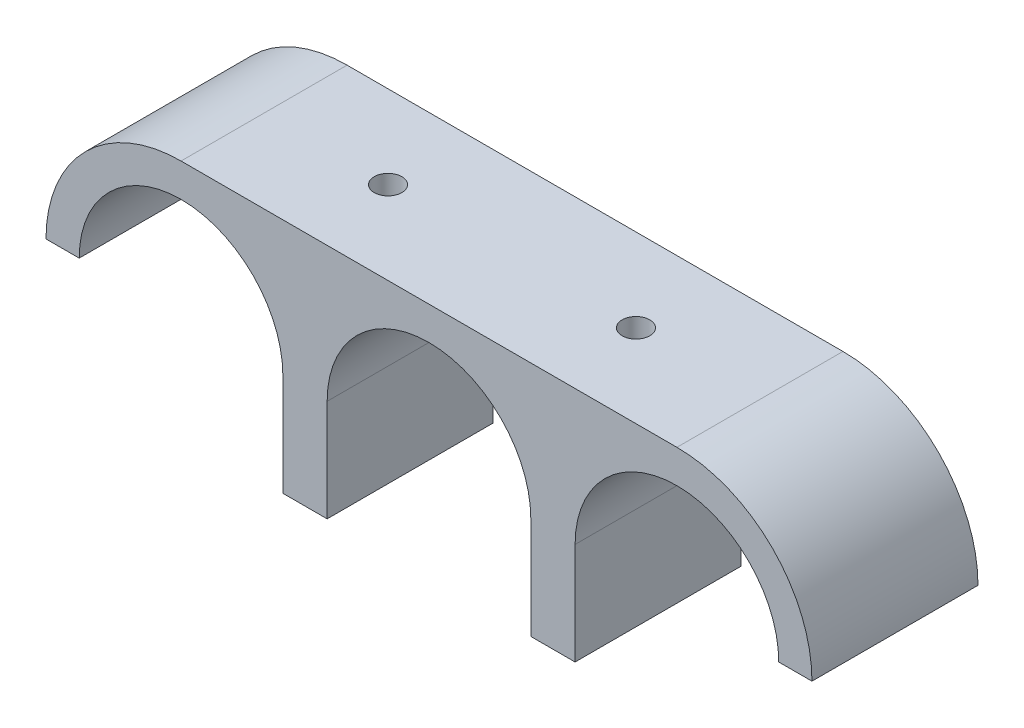
ISO-10303-21;
HEADER;
FILE_DESCRIPTION(('STEP AP214'),'2;1');
FILE_NAME('part.step','',(''),(''),'','','');
FILE_SCHEMA(('AUTOMOTIVE_DESIGN { 1 0 10303 214 1 1 1 1 }'));
ENDSEC;
DATA;
#1=APPLICATION_CONTEXT('core data for automotive mechanical design processes');
#2=APPLICATION_PROTOCOL_DEFINITION('international standard','automotive_design',2000,#1);
#3=PRODUCT_CONTEXT('',#1,'mechanical');
#4=PRODUCT('Part','Part','',(#3));
#5=PRODUCT_RELATED_PRODUCT_CATEGORY('part','',(#4));
#6=PRODUCT_DEFINITION_FORMATION('','',#4);
#7=PRODUCT_DEFINITION_CONTEXT('part definition',#1,'design');
#8=PRODUCT_DEFINITION('design','',#6,#7);
#9=PRODUCT_DEFINITION_SHAPE('','',#8);
#10=(LENGTH_UNIT() NAMED_UNIT(*) SI_UNIT(.MILLI.,.METRE.));
#11=(NAMED_UNIT(*) PLANE_ANGLE_UNIT() SI_UNIT($,.RADIAN.));
#12=(NAMED_UNIT(*) SI_UNIT($,.STERADIAN.) SOLID_ANGLE_UNIT());
#13=UNCERTAINTY_MEASURE_WITH_UNIT(LENGTH_MEASURE(1.E-05),#10,'distance_accuracy_value','');
#14=(GEOMETRIC_REPRESENTATION_CONTEXT(3) GLOBAL_UNCERTAINTY_ASSIGNED_CONTEXT((#13)) GLOBAL_UNIT_ASSIGNED_CONTEXT((#10,
#11,#12)) REPRESENTATION_CONTEXT('',''));
#15=CARTESIAN_POINT('',(0.,0.,0.));
#16=DIRECTION('',(0.,0.,1.));
#17=DIRECTION('',(1.,0.,0.));
#18=AXIS2_PLACEMENT_3D('',#15,#16,#17);
#19=CARTESIAN_POINT('',(26.4096952908587,0.,15.));
#20=DIRECTION('',(0.,0.,-1.));
#21=DIRECTION('',(-1.,0.,0.));
#22=AXIS2_PLACEMENT_3D('',#19,#20,#21);
#23=CYLINDRICAL_SURFACE('',#22,9.2);
#24=CARTESIAN_POINT('',(26.4096952908587,0.,0.));
#25=DIRECTION('',(0.,0.,-1.));
#26=DIRECTION('',(1.,0.,0.));
#27=AXIS2_PLACEMENT_3D('',#24,#25,#26);
#28=CIRCLE('',#27,9.2);
#29=CARTESIAN_POINT('',(17.2096952908587,0.,0.));
#30=VERTEX_POINT('',#29);
#31=CARTESIAN_POINT('',(35.6096952908587,0.,0.));
#32=VERTEX_POINT('',#31);
#33=EDGE_CURVE('E168',#30,#32,#28,.T.);
#34=ORIENTED_EDGE('',*,*,#33,.T.);
#35=DIRECTION('',(0.,0.,-1.));
#36=VECTOR('',#35,1.);
#37=CARTESIAN_POINT('',(35.6096952908587,0.,15.));
#38=LINE('',#37,#36);
#39=CARTESIAN_POINT('',(35.6096952908587,0.,15.));
#40=VERTEX_POINT('',#39);
#41=EDGE_CURVE('E11',#40,#32,#38,.T.);
#42=ORIENTED_EDGE('',*,*,#41,.F.);
#43=CARTESIAN_POINT('',(26.4096952908587,0.,15.));
#44=DIRECTION('',(0.,0.,-1.));
#45=DIRECTION('',(1.,0.,0.));
#46=AXIS2_PLACEMENT_3D('',#43,#44,#45);
#47=CIRCLE('',#46,9.2);
#48=CARTESIAN_POINT('',(17.2096952908587,0.,15.));
#49=VERTEX_POINT('',#48);
#50=EDGE_CURVE('E195',#49,#40,#47,.T.);
#51=ORIENTED_EDGE('',*,*,#50,.F.);
#52=DIRECTION('',(0.,0.,-1.));
#53=VECTOR('',#52,1.);
#54=CARTESIAN_POINT('',(17.2096952908587,0.,15.));
#55=LINE('',#54,#53);
#56=EDGE_CURVE('E164',#49,#30,#55,.T.);
#57=ORIENTED_EDGE('',*,*,#56,.T.);
#58=EDGE_LOOP('',(#34,#42,#51,#57));
#59=FACE_BOUND('',#58,.T.);
#60=ADVANCED_FACE('F36',(#59),#23,.F.);
#61=CARTESIAN_POINT('',(35.6096952908587,0.,15.));
#62=DIRECTION('',(0.,1.,0.));
#63=DIRECTION('',(-1.,0.,0.));
#64=AXIS2_PLACEMENT_3D('',#61,#62,#63);
#65=PLANE('',#64);
#66=DIRECTION('',(1.,0.,0.));
#67=VECTOR('',#66,1.);
#68=CARTESIAN_POINT('',(35.6096952908587,0.,0.));
#69=LINE('',#68,#67);
#70=CARTESIAN_POINT('',(38.6096952908587,0.,0.));
#71=VERTEX_POINT('',#70);
#72=EDGE_CURVE('E171',#32,#71,#69,.T.);
#73=ORIENTED_EDGE('',*,*,#72,.T.);
#74=DIRECTION('',(0.,0.,-1.));
#75=VECTOR('',#74,1.);
#76=CARTESIAN_POINT('',(38.6096952908587,0.,15.));
#77=LINE('',#76,#75);
#78=CARTESIAN_POINT('',(38.6096952908587,0.,15.));
#79=VERTEX_POINT('',#78);
#80=EDGE_CURVE('E44',#79,#71,#77,.T.);
#81=ORIENTED_EDGE('',*,*,#80,.F.);
#82=DIRECTION('',(1.,0.,0.));
#83=VECTOR('',#82,1.);
#84=CARTESIAN_POINT('',(35.6096952908587,0.,15.));
#85=LINE('',#84,#83);
#86=EDGE_CURVE('E113',#40,#79,#85,.T.);
#87=ORIENTED_EDGE('',*,*,#86,.F.);
#88=ORIENTED_EDGE('',*,*,#41,.T.);
#89=EDGE_LOOP('',(#73,#81,#87,#88));
#90=FACE_BOUND('',#89,.T.);
#91=ADVANCED_FACE('F284',(#90),#65,.F.);
#92=CARTESIAN_POINT('',(26.4096952908587,0.,15.));
#93=DIRECTION('',(0.,0.,-1.));
#94=DIRECTION('',(-1.,0.,0.));
#95=AXIS2_PLACEMENT_3D('',#92,#93,#94);
#96=CYLINDRICAL_SURFACE('',#95,12.2);
#97=CARTESIAN_POINT('',(26.4096952908587,0.,0.));
#98=DIRECTION('',(0.,0.,1.));
#99=DIRECTION('',(-1.,0.,0.));
#100=AXIS2_PLACEMENT_3D('',#97,#98,#99);
#101=CIRCLE('',#100,12.2);
#102=CARTESIAN_POINT('',(26.4096952908587,12.2,0.));
#103=VERTEX_POINT('',#102);
#104=EDGE_CURVE('E174',#71,#103,#101,.T.);
#105=ORIENTED_EDGE('',*,*,#104,.T.);
#106=DIRECTION('',(0.,0.,-1.));
#107=VECTOR('',#106,1.);
#108=CARTESIAN_POINT('',(26.4096952908587,12.2,15.));
#109=LINE('',#108,#107);
#110=CARTESIAN_POINT('',(26.4096952908587,12.2,15.));
#111=VERTEX_POINT('',#110);
#112=EDGE_CURVE('E220',#111,#103,#109,.T.);
#113=ORIENTED_EDGE('',*,*,#112,.F.);
#114=CARTESIAN_POINT('',(26.4096952908587,0.,15.));
#115=DIRECTION('',(0.,0.,1.));
#116=DIRECTION('',(-1.,0.,0.));
#117=AXIS2_PLACEMENT_3D('',#114,#115,#116);
#118=CIRCLE('',#117,12.2);
#119=EDGE_CURVE('E228',#79,#111,#118,.T.);
#120=ORIENTED_EDGE('',*,*,#119,.F.);
#121=ORIENTED_EDGE('',*,*,#80,.T.);
#122=EDGE_LOOP('',(#105,#113,#120,#121));
#123=FACE_BOUND('',#122,.T.);
#124=ADVANCED_FACE('F226',(#123),#96,.T.);
#125=CARTESIAN_POINT('',(-18.3903047091413,12.2,15.));
#126=DIRECTION('',(0.,-1.,0.));
#127=DIRECTION('',(1.,0.,0.));
#128=AXIS2_PLACEMENT_3D('',#125,#126,#127);
#129=PLANE('',#128);
#130=CARTESIAN_POINT('',(-7.19030470914127,12.2,7.5));
#131=DIRECTION('',(0.,-1.,0.));
#132=DIRECTION('',(0.,0.,-1.));
#133=AXIS2_PLACEMENT_3D('',#130,#131,#132);
#134=CIRCLE('',#133,1.24999999999999);
#135=CARTESIAN_POINT('',(-7.19030470914127,12.2,6.25000000000001));
#136=VERTEX_POINT('',#135);
#137=EDGE_CURVE('E433',#136,#136,#134,.T.);
#138=ORIENTED_EDGE('',*,*,#137,.T.);
#139=EDGE_LOOP('',(#138));
#140=FACE_BOUND('',#139,.T.);
#141=CARTESIAN_POINT('',(15.2096952908587,12.2,7.5));
#142=DIRECTION('',(0.,-1.,0.));
#143=DIRECTION('',(0.,0.,-1.));
#144=AXIS2_PLACEMENT_3D('',#141,#142,#143);
#145=CIRCLE('',#144,1.24999999999999);
#146=CARTESIAN_POINT('',(15.2096952908587,12.2,6.25000000000001));
#147=VERTEX_POINT('',#146);
#148=EDGE_CURVE('E172',#147,#147,#145,.T.);
#149=ORIENTED_EDGE('',*,*,#148,.T.);
#150=EDGE_LOOP('',(#149));
#151=FACE_BOUND('',#150,.T.);
#152=DIRECTION('',(-1.,0.,0.));
#153=VECTOR('',#152,1.);
#154=CARTESIAN_POINT('',(-18.3903047091413,12.2,0.));
#155=LINE('',#154,#153);
#156=CARTESIAN_POINT('',(-18.3903047091413,12.2,0.));
#157=VERTEX_POINT('',#156);
#158=EDGE_CURVE('E176',#103,#157,#155,.T.);
#159=ORIENTED_EDGE('',*,*,#158,.T.);
#160=DIRECTION('',(0.,0.,-1.));
#161=VECTOR('',#160,1.);
#162=CARTESIAN_POINT('',(-18.3903047091413,12.2,15.));
#163=LINE('',#162,#161);
#164=CARTESIAN_POINT('',(-18.3903047091413,12.2,15.));
#165=VERTEX_POINT('',#164);
#166=EDGE_CURVE('E217',#165,#157,#163,.T.);
#167=ORIENTED_EDGE('',*,*,#166,.F.);
#168=DIRECTION('',(-1.,0.,0.));
#169=VECTOR('',#168,1.);
#170=CARTESIAN_POINT('',(-18.3903047091413,12.2,15.));
#171=LINE('',#170,#169);
#172=EDGE_CURVE('E246',#111,#165,#171,.T.);
#173=ORIENTED_EDGE('',*,*,#172,.F.);
#174=ORIENTED_EDGE('',*,*,#112,.T.);
#175=EDGE_LOOP('',(#159,#167,#173,#174));
#176=FACE_BOUND('',#175,.T.);
#177=ADVANCED_FACE('F237',(#140,#151,#176),#129,.F.);
#178=CARTESIAN_POINT('',(-18.3903047091413,0.,15.));
#179=DIRECTION('',(0.,0.,-1.));
#180=DIRECTION('',(-1.,0.,0.));
#181=AXIS2_PLACEMENT_3D('',#178,#179,#180);
#182=CYLINDRICAL_SURFACE('',#181,12.2);
#183=CARTESIAN_POINT('',(-18.3903047091413,0.,0.));
#184=DIRECTION('',(0.,0.,1.));
#185=DIRECTION('',(1.,0.,0.));
#186=AXIS2_PLACEMENT_3D('',#183,#184,#185);
#187=CIRCLE('',#186,12.2);
#188=CARTESIAN_POINT('',(-30.5903047091413,0.,0.));
#189=VERTEX_POINT('',#188);
#190=EDGE_CURVE('E178',#157,#189,#187,.T.);
#191=ORIENTED_EDGE('',*,*,#190,.T.);
#192=DIRECTION('',(0.,0.,-1.));
#193=VECTOR('',#192,1.);
#194=CARTESIAN_POINT('',(-30.5903047091413,0.,15.));
#195=LINE('',#194,#193);
#196=CARTESIAN_POINT('',(-30.5903047091413,0.,15.));
#197=VERTEX_POINT('',#196);
#198=EDGE_CURVE('E214',#197,#189,#195,.T.);
#199=ORIENTED_EDGE('',*,*,#198,.F.);
#200=CARTESIAN_POINT('',(-18.3903047091413,0.,15.));
#201=DIRECTION('',(0.,0.,1.));
#202=DIRECTION('',(1.,0.,0.));
#203=AXIS2_PLACEMENT_3D('',#200,#201,#202);
#204=CIRCLE('',#203,12.2);
#205=EDGE_CURVE('E243',#165,#197,#204,.T.);
#206=ORIENTED_EDGE('',*,*,#205,.F.);
#207=ORIENTED_EDGE('',*,*,#166,.T.);
#208=EDGE_LOOP('',(#191,#199,#206,#207));
#209=FACE_BOUND('',#208,.T.);
#210=ADVANCED_FACE('F241',(#209),#182,.T.);
#211=CARTESIAN_POINT('',(-30.5903047091413,0.,15.));
#212=DIRECTION('',(0.,1.,0.));
#213=DIRECTION('',(0.,0.,1.));
#214=AXIS2_PLACEMENT_3D('',#211,#212,#213);
#215=PLANE('',#214);
#216=DIRECTION('',(1.,0.,0.));
#217=VECTOR('',#216,1.);
#218=CARTESIAN_POINT('',(-30.5903047091413,0.,0.));
#219=LINE('',#218,#217);
#220=CARTESIAN_POINT('',(-27.5903047091413,0.,0.));
#221=VERTEX_POINT('',#220);
#222=EDGE_CURVE('E180',#189,#221,#219,.T.);
#223=ORIENTED_EDGE('',*,*,#222,.T.);
#224=DIRECTION('',(0.,0.,-1.));
#225=VECTOR('',#224,1.);
#226=CARTESIAN_POINT('',(-27.5903047091413,0.,15.));
#227=LINE('',#226,#225);
#228=CARTESIAN_POINT('',(-27.5903047091413,0.,15.));
#229=VERTEX_POINT('',#228);
#230=EDGE_CURVE('E211',#229,#221,#227,.T.);
#231=ORIENTED_EDGE('',*,*,#230,.F.);
#232=DIRECTION('',(1.,0.,0.));
#233=VECTOR('',#232,1.);
#234=CARTESIAN_POINT('',(-30.5903047091413,0.,15.));
#235=LINE('',#234,#233);
#236=EDGE_CURVE('E245',#197,#229,#235,.T.);
#237=ORIENTED_EDGE('',*,*,#236,.F.);
#238=ORIENTED_EDGE('',*,*,#198,.T.);
#239=EDGE_LOOP('',(#223,#231,#237,#238));
#240=FACE_BOUND('',#239,.T.);
#241=ADVANCED_FACE('F298',(#240),#215,.F.);
#242=CARTESIAN_POINT('',(-18.3903047091413,0.,15.));
#243=DIRECTION('',(0.,0.,-1.));
#244=DIRECTION('',(-1.,0.,0.));
#245=AXIS2_PLACEMENT_3D('',#242,#243,#244);
#246=CYLINDRICAL_SURFACE('',#245,9.2);
#247=CARTESIAN_POINT('',(-18.3903047091413,0.,0.));
#248=DIRECTION('',(0.,0.,-1.));
#249=DIRECTION('',(1.,0.,0.));
#250=AXIS2_PLACEMENT_3D('',#247,#248,#249);
#251=CIRCLE('',#250,9.2);
#252=CARTESIAN_POINT('',(-9.19030470914128,0.,0.));
#253=VERTEX_POINT('',#252);
#254=EDGE_CURVE('E182',#221,#253,#251,.T.);
#255=ORIENTED_EDGE('',*,*,#254,.T.);
#256=DIRECTION('',(0.,0.,-1.));
#257=VECTOR('',#256,1.);
#258=CARTESIAN_POINT('',(-9.19030470914128,0.,15.));
#259=LINE('',#258,#257);
#260=CARTESIAN_POINT('',(-9.19030470914128,0.,15.));
#261=VERTEX_POINT('',#260);
#262=EDGE_CURVE('E208',#261,#253,#259,.T.);
#263=ORIENTED_EDGE('',*,*,#262,.F.);
#264=CARTESIAN_POINT('',(-18.3903047091413,0.,15.));
#265=DIRECTION('',(0.,0.,-1.));
#266=DIRECTION('',(1.,0.,0.));
#267=AXIS2_PLACEMENT_3D('',#264,#265,#266);
#268=CIRCLE('',#267,9.2);
#269=EDGE_CURVE('E248',#229,#261,#268,.T.);
#270=ORIENTED_EDGE('',*,*,#269,.F.);
#271=ORIENTED_EDGE('',*,*,#230,.T.);
#272=EDGE_LOOP('',(#255,#263,#270,#271));
#273=FACE_BOUND('',#272,.T.);
#274=ADVANCED_FACE('F301',(#273),#246,.F.);
#275=CARTESIAN_POINT('',(-9.19030470914128,0.,15.));
#276=DIRECTION('',(1.,0.,0.));
#277=DIRECTION('',(0.,1.,0.));
#278=AXIS2_PLACEMENT_3D('',#275,#276,#277);
#279=PLANE('',#278);
#280=DIRECTION('',(0.,-1.,0.));
#281=VECTOR('',#280,1.);
#282=CARTESIAN_POINT('',(-9.19030470914128,0.,0.));
#283=LINE('',#282,#281);
#284=CARTESIAN_POINT('',(-9.19030470914127,-9.2,0.));
#285=VERTEX_POINT('',#284);
#286=EDGE_CURVE('E184',#253,#285,#283,.T.);
#287=ORIENTED_EDGE('',*,*,#286,.T.);
#288=DIRECTION('',(0.,0.,-1.));
#289=VECTOR('',#288,1.);
#290=CARTESIAN_POINT('',(-9.19030470914127,-9.2,15.));
#291=LINE('',#290,#289);
#292=CARTESIAN_POINT('',(-9.19030470914127,-9.2,15.));
#293=VERTEX_POINT('',#292);
#294=EDGE_CURVE('E205',#293,#285,#291,.T.);
#295=ORIENTED_EDGE('',*,*,#294,.F.);
#296=DIRECTION('',(0.,-1.,0.));
#297=VECTOR('',#296,1.);
#298=CARTESIAN_POINT('',(-9.19030470914128,0.,15.));
#299=LINE('',#298,#297);
#300=EDGE_CURVE('E254',#261,#293,#299,.T.);
#301=ORIENTED_EDGE('',*,*,#300,.F.);
#302=ORIENTED_EDGE('',*,*,#262,.T.);
#303=EDGE_LOOP('',(#287,#295,#301,#302));
#304=FACE_BOUND('',#303,.T.);
#305=ADVANCED_FACE('F305',(#304),#279,.F.);
#306=CARTESIAN_POINT('',(-9.19030470914127,-9.2,15.));
#307=DIRECTION('',(0.,1.,0.));
#308=DIRECTION('',(0.,0.,1.));
#309=AXIS2_PLACEMENT_3D('',#306,#307,#308);
#310=PLANE('',#309);
#311=CARTESIAN_POINT('',(-7.19030470914127,-9.2,7.5));
#312=DIRECTION('',(0.,-1.,0.));
#313=DIRECTION('',(0.,0.,-1.));
#314=AXIS2_PLACEMENT_3D('',#311,#312,#313);
#315=CIRCLE('',#314,1.24999999999999);
#316=CARTESIAN_POINT('',(-7.19030470914127,-9.2,6.25000000000001));
#317=VERTEX_POINT('',#316);
#318=EDGE_CURVE('E436',#317,#317,#315,.T.);
#319=ORIENTED_EDGE('',*,*,#318,.F.);
#320=EDGE_LOOP('',(#319));
#321=FACE_BOUND('',#320,.T.);
#322=DIRECTION('',(1.,0.,0.));
#323=VECTOR('',#322,1.);
#324=CARTESIAN_POINT('',(-9.19030470914127,-9.2,0.));
#325=LINE('',#324,#323);
#326=CARTESIAN_POINT('',(-5.19030470914128,-9.2,0.));
#327=VERTEX_POINT('',#326);
#328=EDGE_CURVE('E186',#285,#327,#325,.T.);
#329=ORIENTED_EDGE('',*,*,#328,.T.);
#330=DIRECTION('',(0.,0.,-1.));
#331=VECTOR('',#330,1.);
#332=CARTESIAN_POINT('',(-5.19030470914128,-9.2,15.));
#333=LINE('',#332,#331);
#334=CARTESIAN_POINT('',(-5.19030470914128,-9.2,15.));
#335=VERTEX_POINT('',#334);
#336=EDGE_CURVE('E202',#335,#327,#333,.T.);
#337=ORIENTED_EDGE('',*,*,#336,.F.);
#338=DIRECTION('',(1.,0.,0.));
#339=VECTOR('',#338,1.);
#340=CARTESIAN_POINT('',(-9.19030470914127,-9.2,15.));
#341=LINE('',#340,#339);
#342=EDGE_CURVE('E256',#293,#335,#341,.T.);
#343=ORIENTED_EDGE('',*,*,#342,.F.);
#344=ORIENTED_EDGE('',*,*,#294,.T.);
#345=EDGE_LOOP('',(#329,#337,#343,#344));
#346=FACE_BOUND('',#345,.T.);
#347=ADVANCED_FACE('F309',(#321,#346),#310,.F.);
#348=CARTESIAN_POINT('',(-5.19030470914128,-9.2,15.));
#349=DIRECTION('',(-1.,0.,0.));
#350=DIRECTION('',(0.,0.,1.));
#351=AXIS2_PLACEMENT_3D('',#348,#349,#350);
#352=PLANE('',#351);
#353=DIRECTION('',(0.,1.,0.));
#354=VECTOR('',#353,1.);
#355=CARTESIAN_POINT('',(-5.19030470914128,-9.2,0.));
#356=LINE('',#355,#354);
#357=CARTESIAN_POINT('',(-5.19030470914128,0.,0.));
#358=VERTEX_POINT('',#357);
#359=EDGE_CURVE('E188',#327,#358,#356,.T.);
#360=ORIENTED_EDGE('',*,*,#359,.T.);
#361=DIRECTION('',(0.,0.,-1.));
#362=VECTOR('',#361,1.);
#363=CARTESIAN_POINT('',(-5.19030470914128,0.,15.));
#364=LINE('',#363,#362);
#365=CARTESIAN_POINT('',(-5.19030470914128,0.,15.));
#366=VERTEX_POINT('',#365);
#367=EDGE_CURVE('E199',#366,#358,#364,.T.);
#368=ORIENTED_EDGE('',*,*,#367,.F.);
#369=DIRECTION('',(0.,1.,0.));
#370=VECTOR('',#369,1.);
#371=CARTESIAN_POINT('',(-5.19030470914128,-9.2,15.));
#372=LINE('',#371,#370);
#373=EDGE_CURVE('E258',#335,#366,#372,.T.);
#374=ORIENTED_EDGE('',*,*,#373,.F.);
#375=ORIENTED_EDGE('',*,*,#336,.T.);
#376=EDGE_LOOP('',(#360,#368,#374,#375));
#377=FACE_BOUND('',#376,.T.);
#378=ADVANCED_FACE('F264',(#377),#352,.F.);
#379=CARTESIAN_POINT('',(4.00969529085872,0.,15.));
#380=DIRECTION('',(0.,0.,-1.));
#381=DIRECTION('',(-1.,0.,0.));
#382=AXIS2_PLACEMENT_3D('',#379,#380,#381);
#383=CYLINDRICAL_SURFACE('',#382,9.2);
#384=CARTESIAN_POINT('',(4.00969529085872,0.,0.));
#385=DIRECTION('',(0.,0.,-1.));
#386=DIRECTION('',(1.,0.,0.));
#387=AXIS2_PLACEMENT_3D('',#384,#385,#386);
#388=CIRCLE('',#387,9.2);
#389=CARTESIAN_POINT('',(13.2096952908587,0.,0.));
#390=VERTEX_POINT('',#389);
#391=EDGE_CURVE('E190',#358,#390,#388,.T.);
#392=ORIENTED_EDGE('',*,*,#391,.T.);
#393=DIRECTION('',(0.,0.,-1.));
#394=VECTOR('',#393,1.);
#395=CARTESIAN_POINT('',(13.2096952908587,0.,15.));
#396=LINE('',#395,#394);
#397=CARTESIAN_POINT('',(13.2096952908587,0.,15.));
#398=VERTEX_POINT('',#397);
#399=EDGE_CURVE('E159',#398,#390,#396,.T.);
#400=ORIENTED_EDGE('',*,*,#399,.F.);
#401=CARTESIAN_POINT('',(4.00969529085872,0.,15.));
#402=DIRECTION('',(0.,0.,-1.));
#403=DIRECTION('',(1.,0.,0.));
#404=AXIS2_PLACEMENT_3D('',#401,#402,#403);
#405=CIRCLE('',#404,9.2);
#406=EDGE_CURVE('E150',#366,#398,#405,.T.);
#407=ORIENTED_EDGE('',*,*,#406,.F.);
#408=ORIENTED_EDGE('',*,*,#367,.T.);
#409=EDGE_LOOP('',(#392,#400,#407,#408));
#410=FACE_BOUND('',#409,.T.);
#411=ADVANCED_FACE('F268',(#410),#383,.F.);
#412=CARTESIAN_POINT('',(13.2096952908587,0.,15.));
#413=DIRECTION('',(1.,0.,0.));
#414=DIRECTION('',(0.,1.,0.));
#415=AXIS2_PLACEMENT_3D('',#412,#413,#414);
#416=PLANE('',#415);
#417=DIRECTION('',(0.,-1.,0.));
#418=VECTOR('',#417,1.);
#419=CARTESIAN_POINT('',(13.2096952908587,0.,0.));
#420=LINE('',#419,#418);
#421=CARTESIAN_POINT('',(13.2096952908587,-9.2,0.));
#422=VERTEX_POINT('',#421);
#423=EDGE_CURVE('E158',#390,#422,#420,.T.);
#424=ORIENTED_EDGE('',*,*,#423,.T.);
#425=DIRECTION('',(0.,0.,-1.));
#426=VECTOR('',#425,1.);
#427=CARTESIAN_POINT('',(13.2096952908587,-9.2,15.));
#428=LINE('',#427,#426);
#429=CARTESIAN_POINT('',(13.2096952908587,-9.2,15.));
#430=VERTEX_POINT('',#429);
#431=EDGE_CURVE('E155',#430,#422,#428,.T.);
#432=ORIENTED_EDGE('',*,*,#431,.F.);
#433=DIRECTION('',(0.,-1.,0.));
#434=VECTOR('',#433,1.);
#435=CARTESIAN_POINT('',(13.2096952908587,0.,15.));
#436=LINE('',#435,#434);
#437=EDGE_CURVE('E144',#398,#430,#436,.T.);
#438=ORIENTED_EDGE('',*,*,#437,.F.);
#439=ORIENTED_EDGE('',*,*,#399,.T.);
#440=EDGE_LOOP('',(#424,#432,#438,#439));
#441=FACE_BOUND('',#440,.T.);
#442=ADVANCED_FACE('F156',(#441),#416,.F.);
#443=CARTESIAN_POINT('',(13.2096952908587,-9.2,15.));
#444=DIRECTION('',(0.,1.,0.));
#445=DIRECTION('',(-1.,0.,0.));
#446=AXIS2_PLACEMENT_3D('',#443,#444,#445);
#447=PLANE('',#446);
#448=CARTESIAN_POINT('',(15.2096952908587,-9.2,7.5));
#449=DIRECTION('',(0.,-1.,0.));
#450=DIRECTION('',(0.,0.,-1.));
#451=AXIS2_PLACEMENT_3D('',#448,#449,#450);
#452=CIRCLE('',#451,1.24999999999999);
#453=CARTESIAN_POINT('',(15.2096952908587,-9.2,6.25000000000001));
#454=VERTEX_POINT('',#453);
#455=EDGE_CURVE('E438',#454,#454,#452,.T.);
#456=ORIENTED_EDGE('',*,*,#455,.F.);
#457=EDGE_LOOP('',(#456));
#458=FACE_BOUND('',#457,.T.);
#459=DIRECTION('',(1.,0.,0.));
#460=VECTOR('',#459,1.);
#461=CARTESIAN_POINT('',(13.2096952908587,-9.2,0.));
#462=LINE('',#461,#460);
#463=CARTESIAN_POINT('',(17.2096952908587,-9.2,0.));
#464=VERTEX_POINT('',#463);
#465=EDGE_CURVE('E99',#422,#464,#462,.T.);
#466=ORIENTED_EDGE('',*,*,#465,.T.);
#467=DIRECTION('',(0.,0.,-1.));
#468=VECTOR('',#467,1.);
#469=CARTESIAN_POINT('',(17.2096952908587,-9.2,15.));
#470=LINE('',#469,#468);
#471=CARTESIAN_POINT('',(17.2096952908587,-9.2,15.));
#472=VERTEX_POINT('',#471);
#473=EDGE_CURVE('E160',#472,#464,#470,.T.);
#474=ORIENTED_EDGE('',*,*,#473,.F.);
#475=DIRECTION('',(1.,0.,0.));
#476=VECTOR('',#475,1.);
#477=CARTESIAN_POINT('',(13.2096952908587,-9.2,15.));
#478=LINE('',#477,#476);
#479=EDGE_CURVE('E148',#430,#472,#478,.T.);
#480=ORIENTED_EDGE('',*,*,#479,.F.);
#481=ORIENTED_EDGE('',*,*,#431,.T.);
#482=EDGE_LOOP('',(#466,#474,#480,#481));
#483=FACE_BOUND('',#482,.T.);
#484=ADVANCED_FACE('F162',(#458,#483),#447,.F.);
#485=CARTESIAN_POINT('',(17.2096952908587,-9.2,15.));
#486=DIRECTION('',(-1.,0.,0.));
#487=DIRECTION('',(0.,0.,1.));
#488=AXIS2_PLACEMENT_3D('',#485,#486,#487);
#489=PLANE('',#488);
#490=DIRECTION('',(0.,1.,0.));
#491=VECTOR('',#490,1.);
#492=CARTESIAN_POINT('',(17.2096952908587,-9.2,0.));
#493=LINE('',#492,#491);
#494=EDGE_CURVE('E105',#464,#30,#493,.T.);
#495=ORIENTED_EDGE('',*,*,#494,.T.);
#496=ORIENTED_EDGE('',*,*,#56,.F.);
#497=DIRECTION('',(0.,1.,0.));
#498=VECTOR('',#497,1.);
#499=CARTESIAN_POINT('',(17.2096952908587,-9.2,15.));
#500=LINE('',#499,#498);
#501=EDGE_CURVE('E52',#472,#49,#500,.T.);
#502=ORIENTED_EDGE('',*,*,#501,.F.);
#503=ORIENTED_EDGE('',*,*,#473,.T.);
#504=EDGE_LOOP('',(#495,#496,#502,#503));
#505=FACE_BOUND('',#504,.T.);
#506=ADVANCED_FACE('F272',(#505),#489,.F.);
#507=CARTESIAN_POINT('',(26.4096952908587,0.,15.));
#508=DIRECTION('',(0.,0.,1.));
#509=DIRECTION('',(1.,0.,0.));
#510=AXIS2_PLACEMENT_3D('',#507,#508,#509);
#511=PLANE('',#510);
#512=ORIENTED_EDGE('',*,*,#50,.T.);
#513=ORIENTED_EDGE('',*,*,#86,.T.);
#514=ORIENTED_EDGE('',*,*,#119,.T.);
#515=ORIENTED_EDGE('',*,*,#172,.T.);
#516=ORIENTED_EDGE('',*,*,#205,.T.);
#517=ORIENTED_EDGE('',*,*,#236,.T.);
#518=ORIENTED_EDGE('',*,*,#269,.T.);
#519=ORIENTED_EDGE('',*,*,#300,.T.);
#520=ORIENTED_EDGE('',*,*,#342,.T.);
#521=ORIENTED_EDGE('',*,*,#373,.T.);
#522=ORIENTED_EDGE('',*,*,#406,.T.);
#523=ORIENTED_EDGE('',*,*,#437,.T.);
#524=ORIENTED_EDGE('',*,*,#479,.T.);
#525=ORIENTED_EDGE('',*,*,#501,.T.);
#526=EDGE_LOOP('',(#512,#513,#514,#515,#516,#517,#518,#519,#520,#521,#522,#523,#524,#525));
#527=FACE_BOUND('',#526,.T.);
#528=ADVANCED_FACE('F146',(#527),#511,.T.);
#529=CARTESIAN_POINT('',(26.4096952908587,0.,0.));
#530=DIRECTION('',(0.,0.,1.));
#531=DIRECTION('',(1.,0.,0.));
#532=AXIS2_PLACEMENT_3D('',#529,#530,#531);
#533=PLANE('',#532);
#534=ORIENTED_EDGE('',*,*,#33,.F.);
#535=ORIENTED_EDGE('',*,*,#494,.F.);
#536=ORIENTED_EDGE('',*,*,#465,.F.);
#537=ORIENTED_EDGE('',*,*,#423,.F.);
#538=ORIENTED_EDGE('',*,*,#391,.F.);
#539=ORIENTED_EDGE('',*,*,#359,.F.);
#540=ORIENTED_EDGE('',*,*,#328,.F.);
#541=ORIENTED_EDGE('',*,*,#286,.F.);
#542=ORIENTED_EDGE('',*,*,#254,.F.);
#543=ORIENTED_EDGE('',*,*,#222,.F.);
#544=ORIENTED_EDGE('',*,*,#190,.F.);
#545=ORIENTED_EDGE('',*,*,#158,.F.);
#546=ORIENTED_EDGE('',*,*,#104,.F.);
#547=ORIENTED_EDGE('',*,*,#72,.F.);
#548=EDGE_LOOP('',(#534,#535,#536,#537,#538,#539,#540,#541,#542,#543,#544,#545,#546,#547));
#549=FACE_BOUND('',#548,.T.);
#550=ADVANCED_FACE('F232',(#549),#533,.F.);
#551=CARTESIAN_POINT('',(15.2096952908587,-9.2,7.5));
#552=DIRECTION('',(0.,-1.,0.));
#553=DIRECTION('',(0.,0.,-1.));
#554=AXIS2_PLACEMENT_3D('',#551,#552,#553);
#555=CYLINDRICAL_SURFACE('',#554,1.24999999999999);
#556=ORIENTED_EDGE('',*,*,#148,.F.);
#557=EDGE_LOOP('',(#556));
#558=FACE_BOUND('',#557,.T.);
#559=ORIENTED_EDGE('',*,*,#455,.T.);
#560=EDGE_LOOP('',(#559));
#561=FACE_BOUND('',#560,.T.);
#562=ADVANCED_FACE('F337',(#558,#561),#555,.F.);
#563=CARTESIAN_POINT('',(-7.19030470914127,-9.2,7.5));
#564=DIRECTION('',(0.,-1.,0.));
#565=DIRECTION('',(0.,0.,-1.));
#566=AXIS2_PLACEMENT_3D('',#563,#564,#565);
#567=CYLINDRICAL_SURFACE('',#566,1.24999999999999);
#568=ORIENTED_EDGE('',*,*,#137,.F.);
#569=EDGE_LOOP('',(#568));
#570=FACE_BOUND('',#569,.T.);
#571=ORIENTED_EDGE('',*,*,#318,.T.);
#572=EDGE_LOOP('',(#571));
#573=FACE_BOUND('',#572,.T.);
#574=ADVANCED_FACE('F342',(#570,#573),#567,.F.);
#575=CLOSED_SHELL('',(#60,#91,#124,#177,#210,#241,#274,#305,#347,#378,#411,#442,#484,#506,#528,
#550,#562,#574));
#576=MANIFOLD_SOLID_BREP('B2',#575);
#577=ADVANCED_BREP_SHAPE_REPRESENTATION('',(#18,#576),#14);
#578=SHAPE_DEFINITION_REPRESENTATION(#9,#577);
ENDSEC;
END-ISO-10303-21;
